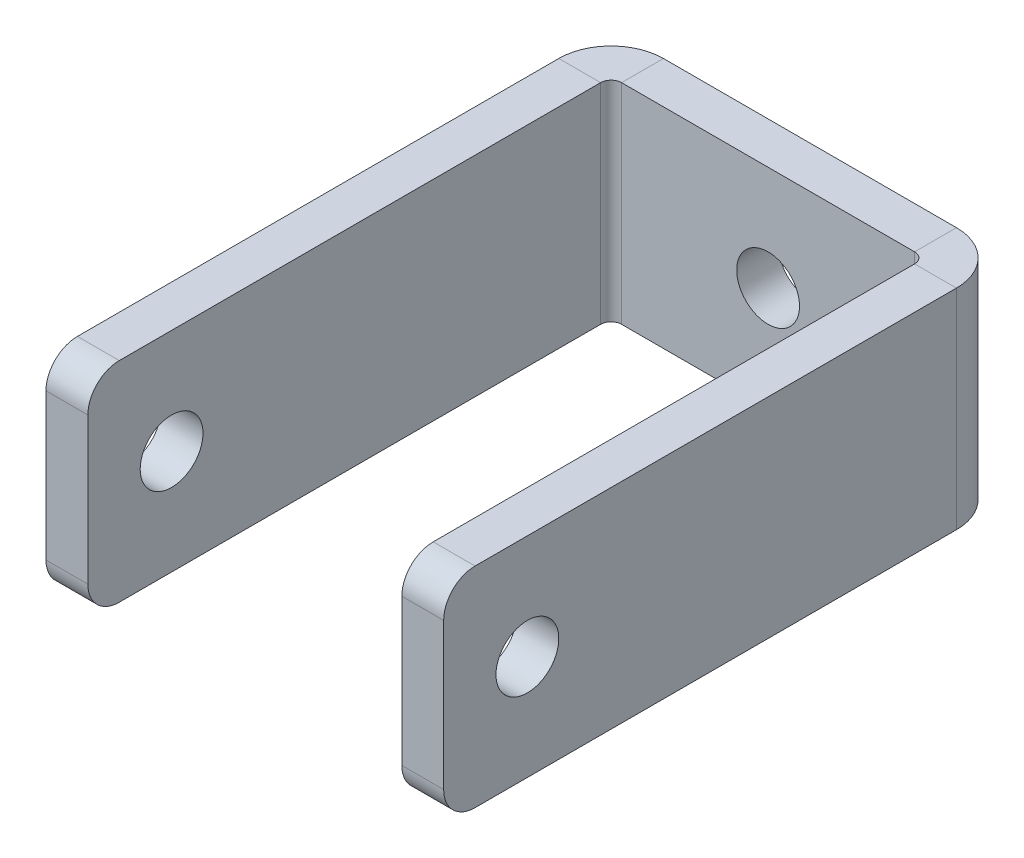
ISO-10303-21;
HEADER;
FILE_DESCRIPTION(('STEP AP214'),'2;1');
FILE_NAME('part.step','',(''),(''),'','','');
FILE_SCHEMA(('AUTOMOTIVE_DESIGN { 1 0 10303 214 1 1 1 1 }'));
ENDSEC;
DATA;
#1=APPLICATION_CONTEXT('core data for automotive mechanical design processes');
#2=APPLICATION_PROTOCOL_DEFINITION('international standard','automotive_design',2000,#1);
#3=PRODUCT_CONTEXT('',#1,'mechanical');
#4=PRODUCT('Part','Part','',(#3));
#5=PRODUCT_RELATED_PRODUCT_CATEGORY('part','',(#4));
#6=PRODUCT_DEFINITION_FORMATION('','',#4);
#7=PRODUCT_DEFINITION_CONTEXT('part definition',#1,'design');
#8=PRODUCT_DEFINITION('design','',#6,#7);
#9=PRODUCT_DEFINITION_SHAPE('','',#8);
#10=(LENGTH_UNIT() NAMED_UNIT(*) SI_UNIT(.MILLI.,.METRE.));
#11=(NAMED_UNIT(*) PLANE_ANGLE_UNIT() SI_UNIT($,.RADIAN.));
#12=(NAMED_UNIT(*) SI_UNIT($,.STERADIAN.) SOLID_ANGLE_UNIT());
#13=UNCERTAINTY_MEASURE_WITH_UNIT(LENGTH_MEASURE(1.E-05),#10,'distance_accuracy_value','');
#14=(GEOMETRIC_REPRESENTATION_CONTEXT(3) GLOBAL_UNCERTAINTY_ASSIGNED_CONTEXT((#13)) GLOBAL_UNIT_ASSIGNED_CONTEXT((#10,
#11,#12)) REPRESENTATION_CONTEXT('',''));
#15=CARTESIAN_POINT('',(0.,0.,0.));
#16=DIRECTION('',(0.,0.,1.));
#17=DIRECTION('',(1.,0.,0.));
#18=AXIS2_PLACEMENT_3D('',#15,#16,#17);
#19=CARTESIAN_POINT('',(0.,0.,-4.));
#20=DIRECTION('',(0.,0.,1.));
#21=DIRECTION('',(1.,0.,0.));
#22=AXIS2_PLACEMENT_3D('',#19,#20,#21);
#23=PLANE('',#22);
#24=CARTESIAN_POINT('',(0.,0.,-4.));
#25=DIRECTION('',(0.,0.,1.));
#26=DIRECTION('',(1.,0.,0.));
#27=AXIS2_PLACEMENT_3D('',#24,#25,#26);
#28=CIRCLE('',#27,3.);
#29=CARTESIAN_POINT('',(3.,0.,-4.));
#30=VERTEX_POINT('',#29);
#31=EDGE_CURVE('E365',#30,#30,#28,.T.);
#32=ORIENTED_EDGE('',*,*,#31,.T.);
#33=EDGE_LOOP('',(#32));
#34=FACE_BOUND('',#33,.T.);
#35=DIRECTION('',(0.,1.,0.));
#36=VECTOR('',#35,1.);
#37=CARTESIAN_POINT('',(14.,10.,-4.));
#38=LINE('',#37,#36);
#39=CARTESIAN_POINT('',(14.,10.,-4.));
#40=VERTEX_POINT('',#39);
#41=CARTESIAN_POINT('',(14.,-9.99999999999997,-4.));
#42=VERTEX_POINT('',#41);
#43=EDGE_CURVE('E163',#40,#42,#38,.F.);
#44=ORIENTED_EDGE('',*,*,#43,.T.);
#45=DIRECTION('',(1.,0.,0.));
#46=VECTOR('',#45,1.);
#47=CARTESIAN_POINT('',(15.,-10.,-4.));
#48=LINE('',#47,#46);
#49=CARTESIAN_POINT('',(-14.,-10.,-4.));
#50=VERTEX_POINT('',#49);
#51=EDGE_CURVE('E267',#50,#42,#48,.T.);
#52=ORIENTED_EDGE('',*,*,#51,.F.);
#53=DIRECTION('',(0.,-1.,0.));
#54=VECTOR('',#53,1.);
#55=CARTESIAN_POINT('',(-14.,-10.,-4.));
#56=LINE('',#55,#54);
#57=CARTESIAN_POINT('',(-14.,10.,-4.));
#58=VERTEX_POINT('',#57);
#59=EDGE_CURVE('E243',#50,#58,#56,.F.);
#60=ORIENTED_EDGE('',*,*,#59,.T.);
#61=DIRECTION('',(-1.,0.,0.));
#62=VECTOR('',#61,1.);
#63=CARTESIAN_POINT('',(15.,10.,-4.));
#64=LINE('',#63,#62);
#65=EDGE_CURVE('E270',#40,#58,#64,.T.);
#66=ORIENTED_EDGE('',*,*,#65,.F.);
#67=EDGE_LOOP('',(#44,#52,#60,#66));
#68=FACE_BOUND('',#67,.T.);
#69=ADVANCED_FACE('F39',(#34,#68),#23,.F.);
#70=CARTESIAN_POINT('',(0.,0.,0.));
#71=DIRECTION('',(0.,0.,1.));
#72=DIRECTION('',(1.,0.,0.));
#73=AXIS2_PLACEMENT_3D('',#70,#71,#72);
#74=PLANE('',#73);
#75=CARTESIAN_POINT('',(0.,0.,0.));
#76=DIRECTION('',(0.,0.,1.));
#77=DIRECTION('',(1.,0.,0.));
#78=AXIS2_PLACEMENT_3D('',#75,#76,#77);
#79=CIRCLE('',#78,3.);
#80=CARTESIAN_POINT('',(3.,0.,0.));
#81=VERTEX_POINT('',#80);
#82=EDGE_CURVE('E370',#81,#81,#79,.T.);
#83=ORIENTED_EDGE('',*,*,#82,.F.);
#84=EDGE_LOOP('',(#83));
#85=FACE_BOUND('',#84,.T.);
#86=DIRECTION('',(1.,0.,0.));
#87=VECTOR('',#86,1.);
#88=CARTESIAN_POINT('',(15.,-10.,0.));
#89=LINE('',#88,#87);
#90=CARTESIAN_POINT('',(-14.,-10.,0.));
#91=VERTEX_POINT('',#90);
#92=CARTESIAN_POINT('',(14.,-10.,0.));
#93=VERTEX_POINT('',#92);
#94=EDGE_CURVE('E264',#91,#93,#89,.T.);
#95=ORIENTED_EDGE('',*,*,#94,.T.);
#96=DIRECTION('',(0.,1.,0.));
#97=VECTOR('',#96,1.);
#98=CARTESIAN_POINT('',(14.,10.,0.));
#99=LINE('',#98,#97);
#100=CARTESIAN_POINT('',(14.,10.,0.));
#101=VERTEX_POINT('',#100);
#102=EDGE_CURVE('E210',#101,#93,#99,.F.);
#103=ORIENTED_EDGE('',*,*,#102,.F.);
#104=DIRECTION('',(-1.,0.,0.));
#105=VECTOR('',#104,1.);
#106=CARTESIAN_POINT('',(15.,10.,0.));
#107=LINE('',#106,#105);
#108=CARTESIAN_POINT('',(-14.,10.,0.));
#109=VERTEX_POINT('',#108);
#110=EDGE_CURVE('E271',#101,#109,#107,.T.);
#111=ORIENTED_EDGE('',*,*,#110,.T.);
#112=DIRECTION('',(0.,-1.,0.));
#113=VECTOR('',#112,1.);
#114=CARTESIAN_POINT('',(-14.,-10.,0.));
#115=LINE('',#114,#113);
#116=EDGE_CURVE('E256',#91,#109,#115,.F.);
#117=ORIENTED_EDGE('',*,*,#116,.F.);
#118=EDGE_LOOP('',(#95,#103,#111,#117));
#119=FACE_BOUND('',#118,.T.);
#120=ADVANCED_FACE('F348',(#85,#119),#74,.T.);
#121=CARTESIAN_POINT('',(15.,10.,-4.));
#122=DIRECTION('',(0.,1.,0.));
#123=DIRECTION('',(-1.,0.,0.));
#124=AXIS2_PLACEMENT_3D('',#121,#122,#123);
#125=PLANE('',#124);
#126=ORIENTED_EDGE('',*,*,#110,.F.);
#127=DIRECTION('',(0.,0.,-1.));
#128=VECTOR('',#127,1.);
#129=CARTESIAN_POINT('',(14.,10.,0.));
#130=LINE('',#129,#128);
#131=EDGE_CURVE('E206',#101,#40,#130,.T.);
#132=ORIENTED_EDGE('',*,*,#131,.T.);
#133=ORIENTED_EDGE('',*,*,#65,.T.);
#134=DIRECTION('',(0.,0.,-1.));
#135=VECTOR('',#134,1.);
#136=CARTESIAN_POINT('',(-14.,10.,0.));
#137=LINE('',#136,#135);
#138=EDGE_CURVE('E261',#109,#58,#137,.T.);
#139=ORIENTED_EDGE('',*,*,#138,.F.);
#140=EDGE_LOOP('',(#126,#132,#133,#139));
#141=FACE_BOUND('',#140,.T.);
#142=ADVANCED_FACE('F343',(#141),#125,.T.);
#143=CARTESIAN_POINT('',(15.,-10.,-4.));
#144=DIRECTION('',(0.,-1.,0.));
#145=DIRECTION('',(1.,0.,0.));
#146=AXIS2_PLACEMENT_3D('',#143,#144,#145);
#147=PLANE('',#146);
#148=DIRECTION('',(0.,0.,-1.));
#149=VECTOR('',#148,1.);
#150=CARTESIAN_POINT('',(14.,-10.,0.));
#151=LINE('',#150,#149);
#152=EDGE_CURVE('E214',#93,#42,#151,.T.);
#153=ORIENTED_EDGE('',*,*,#152,.F.);
#154=ORIENTED_EDGE('',*,*,#94,.F.);
#155=DIRECTION('',(0.,0.,-1.));
#156=VECTOR('',#155,1.);
#157=CARTESIAN_POINT('',(-14.,-10.,0.));
#158=LINE('',#157,#156);
#159=EDGE_CURVE('E250',#91,#50,#158,.T.);
#160=ORIENTED_EDGE('',*,*,#159,.T.);
#161=ORIENTED_EDGE('',*,*,#51,.T.);
#162=EDGE_LOOP('',(#153,#154,#160,#161));
#163=FACE_BOUND('',#162,.T.);
#164=ADVANCED_FACE('F350',(#163),#147,.T.);
#165=CARTESIAN_POINT('',(-14.,10.,1.));
#166=DIRECTION('',(0.,1.,0.));
#167=DIRECTION('',(0.,0.,1.));
#168=AXIS2_PLACEMENT_3D('',#165,#166,#167);
#169=PLANE('',#168);
#170=DIRECTION('',(-1.,0.,0.));
#171=VECTOR('',#170,1.);
#172=CARTESIAN_POINT('',(-15.,10.,0.999999999999997));
#173=LINE('',#172,#171);
#174=CARTESIAN_POINT('',(-15.,10.,0.999999999999997));
#175=VERTEX_POINT('',#174);
#176=CARTESIAN_POINT('',(-19.,10.,0.999999999999983));
#177=VERTEX_POINT('',#176);
#178=EDGE_CURVE('E217',#175,#177,#173,.T.);
#179=ORIENTED_EDGE('',*,*,#178,.F.);
#180=CARTESIAN_POINT('',(-14.,10.,1.));
#181=DIRECTION('',(0.,-1.,0.));
#182=DIRECTION('',(0.,0.,-1.));
#183=AXIS2_PLACEMENT_3D('',#180,#181,#182);
#184=CIRCLE('',#183,1.);
#185=EDGE_CURVE('E253',#109,#175,#184,.F.);
#186=ORIENTED_EDGE('',*,*,#185,.F.);
#187=ORIENTED_EDGE('',*,*,#138,.T.);
#188=CARTESIAN_POINT('',(-14.,10.,1.));
#189=DIRECTION('',(0.,-1.,0.));
#190=DIRECTION('',(0.,0.,-1.));
#191=AXIS2_PLACEMENT_3D('',#188,#189,#190);
#192=CIRCLE('',#191,5.);
#193=EDGE_CURVE('E246',#58,#177,#192,.F.);
#194=ORIENTED_EDGE('',*,*,#193,.T.);
#195=EDGE_LOOP('',(#179,#186,#187,#194));
#196=FACE_BOUND('',#195,.T.);
#197=ADVANCED_FACE('F338',(#196),#169,.T.);
#198=CARTESIAN_POINT('',(-14.,-10.,1.));
#199=DIRECTION('',(0.,1.,0.));
#200=DIRECTION('',(0.,0.,1.));
#201=AXIS2_PLACEMENT_3D('',#198,#199,#200);
#202=PLANE('',#201);
#203=CARTESIAN_POINT('',(-14.,-10.,1.));
#204=DIRECTION('',(0.,-1.,0.));
#205=DIRECTION('',(0.,0.,-1.));
#206=AXIS2_PLACEMENT_3D('',#203,#204,#205);
#207=CIRCLE('',#206,1.);
#208=CARTESIAN_POINT('',(-15.,-10.,0.999999999999997));
#209=VERTEX_POINT('',#208);
#210=EDGE_CURVE('E238',#209,#91,#207,.T.);
#211=ORIENTED_EDGE('',*,*,#210,.F.);
#212=DIRECTION('',(-1.,0.,0.));
#213=VECTOR('',#212,1.);
#214=CARTESIAN_POINT('',(-15.,-10.,0.999999999999997));
#215=LINE('',#214,#213);
#216=CARTESIAN_POINT('',(-19.,-10.,0.999999999999984));
#217=VERTEX_POINT('',#216);
#218=EDGE_CURVE('E222',#209,#217,#215,.T.);
#219=ORIENTED_EDGE('',*,*,#218,.T.);
#220=CARTESIAN_POINT('',(-14.,-10.,1.));
#221=DIRECTION('',(0.,-1.,0.));
#222=DIRECTION('',(0.,0.,-1.));
#223=AXIS2_PLACEMENT_3D('',#220,#221,#222);
#224=CIRCLE('',#223,5.);
#225=EDGE_CURVE('E247',#217,#50,#224,.T.);
#226=ORIENTED_EDGE('',*,*,#225,.T.);
#227=ORIENTED_EDGE('',*,*,#159,.F.);
#228=EDGE_LOOP('',(#211,#219,#226,#227));
#229=FACE_BOUND('',#228,.T.);
#230=ADVANCED_FACE('F331',(#229),#202,.F.);
#231=CARTESIAN_POINT('',(-14.,-10.,1.));
#232=DIRECTION('',(0.,-1.,0.));
#233=DIRECTION('',(-1.,0.,0.));
#234=AXIS2_PLACEMENT_3D('',#231,#232,#233);
#235=CYLINDRICAL_SURFACE('',#234,5.);
#236=ORIENTED_EDGE('',*,*,#59,.F.);
#237=ORIENTED_EDGE('',*,*,#225,.F.);
#238=DIRECTION('',(0.,1.,0.));
#239=VECTOR('',#238,1.);
#240=CARTESIAN_POINT('',(-19.,0.,0.999999999999984));
#241=LINE('',#240,#239);
#242=EDGE_CURVE('E225',#217,#177,#241,.T.);
#243=ORIENTED_EDGE('',*,*,#242,.T.);
#244=ORIENTED_EDGE('',*,*,#193,.F.);
#245=EDGE_LOOP('',(#236,#237,#243,#244));
#246=FACE_BOUND('',#245,.T.);
#247=ADVANCED_FACE('F336',(#246),#235,.T.);
#248=CARTESIAN_POINT('',(-14.,-10.,1.));
#249=DIRECTION('',(0.,-1.,0.));
#250=DIRECTION('',(-1.,0.,0.));
#251=AXIS2_PLACEMENT_3D('',#248,#249,#250);
#252=CYLINDRICAL_SURFACE('',#251,1.);
#253=ORIENTED_EDGE('',*,*,#116,.T.);
#254=ORIENTED_EDGE('',*,*,#185,.T.);
#255=DIRECTION('',(0.,-1.,0.));
#256=VECTOR('',#255,1.);
#257=CARTESIAN_POINT('',(-15.,10.,0.999999999999997));
#258=LINE('',#257,#256);
#259=EDGE_CURVE('E220',#175,#209,#258,.T.);
#260=ORIENTED_EDGE('',*,*,#259,.T.);
#261=ORIENTED_EDGE('',*,*,#210,.T.);
#262=EDGE_LOOP('',(#253,#254,#260,#261));
#263=FACE_BOUND('',#262,.T.);
#264=ADVANCED_FACE('F345',(#263),#252,.F.);
#265=CARTESIAN_POINT('',(-19.0000000000002,-10.,50.));
#266=DIRECTION('',(0.,1.,0.));
#267=DIRECTION('',(0.,0.,1.));
#268=AXIS2_PLACEMENT_3D('',#265,#266,#267);
#269=PLANE('',#268);
#270=DIRECTION('',(0.,0.,1.));
#271=VECTOR('',#270,1.);
#272=CARTESIAN_POINT('',(-15.0000000000002,-10.,50.));
#273=LINE('',#272,#271);
#274=CARTESIAN_POINT('',(-15.0000000000002,-10.,47.));
#275=VERTEX_POINT('',#274);
#276=EDGE_CURVE('E230',#209,#275,#273,.T.);
#277=ORIENTED_EDGE('',*,*,#276,.T.);
#278=DIRECTION('',(1.,0.,0.));
#279=VECTOR('',#278,1.);
#280=CARTESIAN_POINT('',(-19.0000000000002,-10.,47.));
#281=LINE('',#280,#279);
#282=CARTESIAN_POINT('',(-19.0000000000002,-10.,47.));
#283=VERTEX_POINT('',#282);
#284=EDGE_CURVE('E11',#275,#283,#281,.F.);
#285=ORIENTED_EDGE('',*,*,#284,.T.);
#286=DIRECTION('',(0.,0.,1.));
#287=VECTOR('',#286,1.);
#288=CARTESIAN_POINT('',(-19.0000000000002,-10.,50.));
#289=LINE('',#288,#287);
#290=EDGE_CURVE('E231',#217,#283,#289,.T.);
#291=ORIENTED_EDGE('',*,*,#290,.F.);
#292=ORIENTED_EDGE('',*,*,#218,.F.);
#293=EDGE_LOOP('',(#277,#285,#291,#292));
#294=FACE_BOUND('',#293,.T.);
#295=ADVANCED_FACE('F328',(#294),#269,.F.);
#296=CARTESIAN_POINT('',(-19.,10.,0.));
#297=DIRECTION('',(0.,-1.,0.));
#298=DIRECTION('',(0.,0.,-1.));
#299=AXIS2_PLACEMENT_3D('',#296,#297,#298);
#300=PLANE('',#299);
#301=DIRECTION('',(0.,0.,-1.));
#302=VECTOR('',#301,1.);
#303=CARTESIAN_POINT('',(-19.,10.,0.));
#304=LINE('',#303,#302);
#305=CARTESIAN_POINT('',(-19.0000000000002,10.,47.));
#306=VERTEX_POINT('',#305);
#307=EDGE_CURVE('E236',#306,#177,#304,.T.);
#308=ORIENTED_EDGE('',*,*,#307,.F.);
#309=DIRECTION('',(1.,0.,0.));
#310=VECTOR('',#309,1.);
#311=CARTESIAN_POINT('',(-19.0000000000002,10.,47.));
#312=LINE('',#311,#310);
#313=CARTESIAN_POINT('',(-15.0000000000002,10.,47.));
#314=VERTEX_POINT('',#313);
#315=EDGE_CURVE('E293',#306,#314,#312,.T.);
#316=ORIENTED_EDGE('',*,*,#315,.T.);
#317=DIRECTION('',(0.,0.,-1.));
#318=VECTOR('',#317,1.);
#319=CARTESIAN_POINT('',(-15.,10.,0.));
#320=LINE('',#319,#318);
#321=EDGE_CURVE('E234',#314,#175,#320,.T.);
#322=ORIENTED_EDGE('',*,*,#321,.T.);
#323=ORIENTED_EDGE('',*,*,#178,.T.);
#324=EDGE_LOOP('',(#308,#316,#322,#323));
#325=FACE_BOUND('',#324,.T.);
#326=ADVANCED_FACE('F314',(#325),#300,.F.);
#327=CARTESIAN_POINT('',(-19.,0.,0.));
#328=DIRECTION('',(1.,0.,0.));
#329=DIRECTION('',(0.,0.,-1.));
#330=AXIS2_PLACEMENT_3D('',#327,#328,#329);
#331=PLANE('',#330);
#332=CARTESIAN_POINT('',(-19.0000000000001,0.,42.));
#333=DIRECTION('',(-1.,0.,0.));
#334=DIRECTION('',(0.,0.,1.));
#335=AXIS2_PLACEMENT_3D('',#332,#333,#334);
#336=CIRCLE('',#335,3.);
#337=CARTESIAN_POINT('',(-19.0000000000002,0.,45.));
#338=VERTEX_POINT('',#337);
#339=EDGE_CURVE('E376',#338,#338,#336,.T.);
#340=ORIENTED_EDGE('',*,*,#339,.F.);
#341=EDGE_LOOP('',(#340));
#342=FACE_BOUND('',#341,.T.);
#343=DIRECTION('',(0.,1.,0.));
#344=VECTOR('',#343,1.);
#345=CARTESIAN_POINT('',(-19.0000000000002,10.,50.));
#346=LINE('',#345,#344);
#347=CARTESIAN_POINT('',(-19.0000000000002,-7.,50.));
#348=VERTEX_POINT('',#347);
#349=CARTESIAN_POINT('',(-19.0000000000002,7.,50.));
#350=VERTEX_POINT('',#349);
#351=EDGE_CURVE('E233',#348,#350,#346,.T.);
#352=ORIENTED_EDGE('',*,*,#351,.T.);
#353=CARTESIAN_POINT('',(-19.0000000000002,7.,47.));
#354=DIRECTION('',(1.,0.,0.));
#355=DIRECTION('',(0.,0.,-1.));
#356=AXIS2_PLACEMENT_3D('',#353,#354,#355);
#357=CIRCLE('',#356,3.);
#358=EDGE_CURVE('E48',#350,#306,#357,.F.);
#359=ORIENTED_EDGE('',*,*,#358,.T.);
#360=ORIENTED_EDGE('',*,*,#307,.T.);
#361=ORIENTED_EDGE('',*,*,#242,.F.);
#362=ORIENTED_EDGE('',*,*,#290,.T.);
#363=CARTESIAN_POINT('',(-19.0000000000002,-7.,47.));
#364=DIRECTION('',(1.,0.,0.));
#365=DIRECTION('',(0.,0.,-1.));
#366=AXIS2_PLACEMENT_3D('',#363,#364,#365);
#367=CIRCLE('',#366,3.);
#368=EDGE_CURVE('E304',#283,#348,#367,.F.);
#369=ORIENTED_EDGE('',*,*,#368,.T.);
#370=EDGE_LOOP('',(#352,#359,#360,#361,#362,#369));
#371=FACE_BOUND('',#370,.T.);
#372=ADVANCED_FACE('F309',(#342,#371),#331,.F.);
#373=CARTESIAN_POINT('',(-15.,0.,0.));
#374=DIRECTION('',(1.,0.,0.));
#375=DIRECTION('',(0.,0.,-1.));
#376=AXIS2_PLACEMENT_3D('',#373,#374,#375);
#377=PLANE('',#376);
#378=CARTESIAN_POINT('',(-15.0000000000001,0.,42.));
#379=DIRECTION('',(1.,0.,0.));
#380=DIRECTION('',(0.,0.,-1.));
#381=AXIS2_PLACEMENT_3D('',#378,#379,#380);
#382=CIRCLE('',#381,3.);
#383=CARTESIAN_POINT('',(-15.0000000000001,0.,39.));
#384=VERTEX_POINT('',#383);
#385=EDGE_CURVE('E373',#384,#384,#382,.T.);
#386=ORIENTED_EDGE('',*,*,#385,.F.);
#387=EDGE_LOOP('',(#386));
#388=FACE_BOUND('',#387,.T.);
#389=ORIENTED_EDGE('',*,*,#321,.F.);
#390=CARTESIAN_POINT('',(-15.0000000000002,7.,47.));
#391=DIRECTION('',(1.,0.,0.));
#392=DIRECTION('',(0.,0.,-1.));
#393=AXIS2_PLACEMENT_3D('',#390,#391,#392);
#394=CIRCLE('',#393,3.);
#395=CARTESIAN_POINT('',(-15.0000000000002,7.,50.));
#396=VERTEX_POINT('',#395);
#397=EDGE_CURVE('E298',#314,#396,#394,.T.);
#398=ORIENTED_EDGE('',*,*,#397,.T.);
#399=DIRECTION('',(0.,1.,0.));
#400=VECTOR('',#399,1.);
#401=CARTESIAN_POINT('',(-15.0000000000002,10.,50.));
#402=LINE('',#401,#400);
#403=CARTESIAN_POINT('',(-15.0000000000002,-7.,50.));
#404=VERTEX_POINT('',#403);
#405=EDGE_CURVE('E240',#404,#396,#402,.T.);
#406=ORIENTED_EDGE('',*,*,#405,.F.);
#407=CARTESIAN_POINT('',(-15.0000000000002,-7.,47.));
#408=DIRECTION('',(1.,0.,0.));
#409=DIRECTION('',(0.,0.,-1.));
#410=AXIS2_PLACEMENT_3D('',#407,#408,#409);
#411=CIRCLE('',#410,3.);
#412=EDGE_CURVE('E296',#404,#275,#411,.T.);
#413=ORIENTED_EDGE('',*,*,#412,.T.);
#414=ORIENTED_EDGE('',*,*,#276,.F.);
#415=ORIENTED_EDGE('',*,*,#259,.F.);
#416=EDGE_LOOP('',(#389,#398,#406,#413,#414,#415));
#417=FACE_BOUND('',#416,.T.);
#418=ADVANCED_FACE('F320',(#388,#417),#377,.T.);
#419=CARTESIAN_POINT('',(-19.0000000000002,10.,50.));
#420=DIRECTION('',(0.,0.,-1.));
#421=DIRECTION('',(-1.,0.,0.));
#422=AXIS2_PLACEMENT_3D('',#419,#420,#421);
#423=PLANE('',#422);
#424=ORIENTED_EDGE('',*,*,#405,.T.);
#425=DIRECTION('',(1.,0.,0.));
#426=VECTOR('',#425,1.);
#427=CARTESIAN_POINT('',(-19.0000000000002,7.,50.));
#428=LINE('',#427,#426);
#429=EDGE_CURVE('E61',#396,#350,#428,.F.);
#430=ORIENTED_EDGE('',*,*,#429,.T.);
#431=ORIENTED_EDGE('',*,*,#351,.F.);
#432=DIRECTION('',(1.,0.,0.));
#433=VECTOR('',#432,1.);
#434=CARTESIAN_POINT('',(-19.0000000000002,-7.,50.));
#435=LINE('',#434,#433);
#436=EDGE_CURVE('E300',#348,#404,#435,.T.);
#437=ORIENTED_EDGE('',*,*,#436,.T.);
#438=EDGE_LOOP('',(#424,#430,#431,#437));
#439=FACE_BOUND('',#438,.T.);
#440=ADVANCED_FACE('F322',(#439),#423,.F.);
#441=CARTESIAN_POINT('',(14.,-10.,1.));
#442=DIRECTION('',(0.,-1.,0.));
#443=DIRECTION('',(0.,0.,-1.));
#444=AXIS2_PLACEMENT_3D('',#441,#442,#443);
#445=PLANE('',#444);
#446=DIRECTION('',(1.,0.,0.));
#447=VECTOR('',#446,1.);
#448=CARTESIAN_POINT('',(15.,-10.,0.999999999999997));
#449=LINE('',#448,#447);
#450=CARTESIAN_POINT('',(15.,-10.,0.999999999999997));
#451=VERTEX_POINT('',#450);
#452=CARTESIAN_POINT('',(19.,-10.,0.999999999999983));
#453=VERTEX_POINT('',#452);
#454=EDGE_CURVE('E356',#451,#453,#449,.T.);
#455=ORIENTED_EDGE('',*,*,#454,.F.);
#456=CARTESIAN_POINT('',(14.,-10.,1.));
#457=DIRECTION('',(0.,1.,0.));
#458=DIRECTION('',(0.,0.,1.));
#459=AXIS2_PLACEMENT_3D('',#456,#457,#458);
#460=CIRCLE('',#459,1.);
#461=EDGE_CURVE('E166',#93,#451,#460,.F.);
#462=ORIENTED_EDGE('',*,*,#461,.F.);
#463=ORIENTED_EDGE('',*,*,#152,.T.);
#464=CARTESIAN_POINT('',(14.,-10.,1.));
#465=DIRECTION('',(0.,1.,0.));
#466=DIRECTION('',(0.,0.,1.));
#467=AXIS2_PLACEMENT_3D('',#464,#465,#466);
#468=CIRCLE('',#467,5.);
#469=EDGE_CURVE('E205',#42,#453,#468,.F.);
#470=ORIENTED_EDGE('',*,*,#469,.T.);
#471=EDGE_LOOP('',(#455,#462,#463,#470));
#472=FACE_BOUND('',#471,.T.);
#473=ADVANCED_FACE('F354',(#472),#445,.T.);
#474=CARTESIAN_POINT('',(14.,10.,1.));
#475=DIRECTION('',(0.,-1.,0.));
#476=DIRECTION('',(0.,0.,-1.));
#477=AXIS2_PLACEMENT_3D('',#474,#475,#476);
#478=PLANE('',#477);
#479=CARTESIAN_POINT('',(14.,10.,1.));
#480=DIRECTION('',(0.,1.,0.));
#481=DIRECTION('',(0.,0.,1.));
#482=AXIS2_PLACEMENT_3D('',#479,#480,#481);
#483=CIRCLE('',#482,1.);
#484=CARTESIAN_POINT('',(15.,10.,0.999999999999997));
#485=VERTEX_POINT('',#484);
#486=EDGE_CURVE('E173',#485,#101,#483,.T.);
#487=ORIENTED_EDGE('',*,*,#486,.F.);
#488=DIRECTION('',(1.,0.,0.));
#489=VECTOR('',#488,1.);
#490=CARTESIAN_POINT('',(15.,10.,0.999999999999997));
#491=LINE('',#490,#489);
#492=CARTESIAN_POINT('',(19.,10.,0.999999999999984));
#493=VERTEX_POINT('',#492);
#494=EDGE_CURVE('E170',#485,#493,#491,.T.);
#495=ORIENTED_EDGE('',*,*,#494,.T.);
#496=CARTESIAN_POINT('',(14.,10.,1.));
#497=DIRECTION('',(0.,1.,0.));
#498=DIRECTION('',(0.,0.,1.));
#499=AXIS2_PLACEMENT_3D('',#496,#497,#498);
#500=CIRCLE('',#499,5.);
#501=EDGE_CURVE('E156',#493,#40,#500,.T.);
#502=ORIENTED_EDGE('',*,*,#501,.T.);
#503=ORIENTED_EDGE('',*,*,#131,.F.);
#504=EDGE_LOOP('',(#487,#495,#502,#503));
#505=FACE_BOUND('',#504,.T.);
#506=ADVANCED_FACE('F171',(#505),#478,.F.);
#507=CARTESIAN_POINT('',(14.,10.,1.));
#508=DIRECTION('',(0.,1.,0.));
#509=DIRECTION('',(1.,0.,0.));
#510=AXIS2_PLACEMENT_3D('',#507,#508,#509);
#511=CYLINDRICAL_SURFACE('',#510,5.);
#512=ORIENTED_EDGE('',*,*,#43,.F.);
#513=ORIENTED_EDGE('',*,*,#501,.F.);
#514=DIRECTION('',(0.,-1.,0.));
#515=VECTOR('',#514,1.);
#516=CARTESIAN_POINT('',(19.,0.,0.999999999999984));
#517=LINE('',#516,#515);
#518=EDGE_CURVE('E161',#493,#453,#517,.T.);
#519=ORIENTED_EDGE('',*,*,#518,.T.);
#520=ORIENTED_EDGE('',*,*,#469,.F.);
#521=EDGE_LOOP('',(#512,#513,#519,#520));
#522=FACE_BOUND('',#521,.T.);
#523=ADVANCED_FACE('F158',(#522),#511,.T.);
#524=CARTESIAN_POINT('',(14.,10.,1.));
#525=DIRECTION('',(0.,1.,0.));
#526=DIRECTION('',(1.,0.,0.));
#527=AXIS2_PLACEMENT_3D('',#524,#525,#526);
#528=CYLINDRICAL_SURFACE('',#527,1.);
#529=ORIENTED_EDGE('',*,*,#102,.T.);
#530=ORIENTED_EDGE('',*,*,#461,.T.);
#531=DIRECTION('',(0.,1.,0.));
#532=VECTOR('',#531,1.);
#533=CARTESIAN_POINT('',(15.,-10.,0.999999999999997));
#534=LINE('',#533,#532);
#535=EDGE_CURVE('E178',#451,#485,#534,.T.);
#536=ORIENTED_EDGE('',*,*,#535,.T.);
#537=ORIENTED_EDGE('',*,*,#486,.T.);
#538=EDGE_LOOP('',(#529,#530,#536,#537));
#539=FACE_BOUND('',#538,.T.);
#540=ADVANCED_FACE('F359',(#539),#528,.F.);
#541=CARTESIAN_POINT('',(19.,-10.,0.));
#542=DIRECTION('',(0.,1.,0.));
#543=DIRECTION('',(0.,0.,1.));
#544=AXIS2_PLACEMENT_3D('',#541,#542,#543);
#545=PLANE('',#544);
#546=DIRECTION('',(0.,0.,-1.));
#547=VECTOR('',#546,1.);
#548=CARTESIAN_POINT('',(19.,-10.,0.));
#549=LINE('',#548,#547);
#550=CARTESIAN_POINT('',(19.0000000000002,-10.,47.));
#551=VERTEX_POINT('',#550);
#552=EDGE_CURVE('E186',#551,#453,#549,.T.);
#553=ORIENTED_EDGE('',*,*,#552,.F.);
#554=DIRECTION('',(-1.,0.,0.));
#555=VECTOR('',#554,1.);
#556=CARTESIAN_POINT('',(19.0000000000002,-10.,47.));
#557=LINE('',#556,#555);
#558=CARTESIAN_POINT('',(15.0000000000002,-10.,47.));
#559=VERTEX_POINT('',#558);
#560=EDGE_CURVE('E290',#551,#559,#557,.T.);
#561=ORIENTED_EDGE('',*,*,#560,.T.);
#562=DIRECTION('',(0.,0.,-1.));
#563=VECTOR('',#562,1.);
#564=CARTESIAN_POINT('',(15.,-10.,0.));
#565=LINE('',#564,#563);
#566=EDGE_CURVE('E187',#559,#451,#565,.T.);
#567=ORIENTED_EDGE('',*,*,#566,.T.);
#568=ORIENTED_EDGE('',*,*,#454,.T.);
#569=EDGE_LOOP('',(#553,#561,#567,#568));
#570=FACE_BOUND('',#569,.T.);
#571=ADVANCED_FACE('F510',(#570),#545,.F.);
#572=CARTESIAN_POINT('',(19.0000000000002,10.,50.));
#573=DIRECTION('',(0.,-1.,0.));
#574=DIRECTION('',(0.,0.,-1.));
#575=AXIS2_PLACEMENT_3D('',#572,#573,#574);
#576=PLANE('',#575);
#577=DIRECTION('',(0.,0.,1.));
#578=VECTOR('',#577,1.);
#579=CARTESIAN_POINT('',(15.0000000000002,10.,50.));
#580=LINE('',#579,#578);
#581=CARTESIAN_POINT('',(15.0000000000002,10.,47.));
#582=VERTEX_POINT('',#581);
#583=EDGE_CURVE('E200',#485,#582,#580,.T.);
#584=ORIENTED_EDGE('',*,*,#583,.T.);
#585=DIRECTION('',(-1.,0.,0.));
#586=VECTOR('',#585,1.);
#587=CARTESIAN_POINT('',(19.0000000000002,10.,47.));
#588=LINE('',#587,#586);
#589=CARTESIAN_POINT('',(19.0000000000002,10.,47.));
#590=VERTEX_POINT('',#589);
#591=EDGE_CURVE('E191',#582,#590,#588,.F.);
#592=ORIENTED_EDGE('',*,*,#591,.T.);
#593=DIRECTION('',(0.,0.,1.));
#594=VECTOR('',#593,1.);
#595=CARTESIAN_POINT('',(19.0000000000002,10.,50.));
#596=LINE('',#595,#594);
#597=EDGE_CURVE('E183',#493,#590,#596,.T.);
#598=ORIENTED_EDGE('',*,*,#597,.F.);
#599=ORIENTED_EDGE('',*,*,#494,.F.);
#600=EDGE_LOOP('',(#584,#592,#598,#599));
#601=FACE_BOUND('',#600,.T.);
#602=ADVANCED_FACE('F189',(#601),#576,.F.);
#603=CARTESIAN_POINT('',(19.,0.,0.));
#604=DIRECTION('',(-1.,0.,0.));
#605=DIRECTION('',(0.,0.,1.));
#606=AXIS2_PLACEMENT_3D('',#603,#604,#605);
#607=PLANE('',#606);
#608=CARTESIAN_POINT('',(19.0000000000002,0.,42.0000000000001));
#609=DIRECTION('',(-1.,0.,0.));
#610=DIRECTION('',(0.,0.,1.));
#611=AXIS2_PLACEMENT_3D('',#608,#609,#610);
#612=CIRCLE('',#611,3.);
#613=CARTESIAN_POINT('',(19.0000000000002,0.,45.0000000000001));
#614=VERTEX_POINT('',#613);
#615=EDGE_CURVE('E379',#614,#614,#612,.T.);
#616=ORIENTED_EDGE('',*,*,#615,.T.);
#617=EDGE_LOOP('',(#616));
#618=FACE_BOUND('',#617,.T.);
#619=ORIENTED_EDGE('',*,*,#597,.T.);
#620=CARTESIAN_POINT('',(19.0000000000002,7.,47.));
#621=DIRECTION('',(-1.,0.,0.));
#622=DIRECTION('',(0.,0.,1.));
#623=AXIS2_PLACEMENT_3D('',#620,#621,#622);
#624=CIRCLE('',#623,3.);
#625=CARTESIAN_POINT('',(19.0000000000002,7.,50.));
#626=VERTEX_POINT('',#625);
#627=EDGE_CURVE('E288',#590,#626,#624,.F.);
#628=ORIENTED_EDGE('',*,*,#627,.T.);
#629=DIRECTION('',(0.,-1.,0.));
#630=VECTOR('',#629,1.);
#631=CARTESIAN_POINT('',(19.0000000000002,-10.,50.));
#632=LINE('',#631,#630);
#633=CARTESIAN_POINT('',(19.0000000000002,-7.,50.));
#634=VERTEX_POINT('',#633);
#635=EDGE_CURVE('E192',#626,#634,#632,.T.);
#636=ORIENTED_EDGE('',*,*,#635,.T.);
#637=CARTESIAN_POINT('',(19.0000000000002,-7.,47.));
#638=DIRECTION('',(-1.,0.,0.));
#639=DIRECTION('',(0.,0.,1.));
#640=AXIS2_PLACEMENT_3D('',#637,#638,#639);
#641=CIRCLE('',#640,3.);
#642=EDGE_CURVE('E286',#634,#551,#641,.F.);
#643=ORIENTED_EDGE('',*,*,#642,.T.);
#644=ORIENTED_EDGE('',*,*,#552,.T.);
#645=ORIENTED_EDGE('',*,*,#518,.F.);
#646=EDGE_LOOP('',(#619,#628,#636,#643,#644,#645));
#647=FACE_BOUND('',#646,.T.);
#648=ADVANCED_FACE('F182',(#618,#647),#607,.F.);
#649=CARTESIAN_POINT('',(15.,0.,0.));
#650=DIRECTION('',(-1.,0.,0.));
#651=DIRECTION('',(0.,0.,1.));
#652=AXIS2_PLACEMENT_3D('',#649,#650,#651);
#653=PLANE('',#652);
#654=CARTESIAN_POINT('',(15.0000000000001,0.,42.0000000000001));
#655=DIRECTION('',(-1.,0.,0.));
#656=DIRECTION('',(0.,0.,1.));
#657=AXIS2_PLACEMENT_3D('',#654,#655,#656);
#658=CIRCLE('',#657,3.);
#659=CARTESIAN_POINT('',(15.0000000000002,0.,45.0000000000001));
#660=VERTEX_POINT('',#659);
#661=EDGE_CURVE('E43',#660,#660,#658,.T.);
#662=ORIENTED_EDGE('',*,*,#661,.F.);
#663=EDGE_LOOP('',(#662));
#664=FACE_BOUND('',#663,.T.);
#665=DIRECTION('',(0.,-1.,0.));
#666=VECTOR('',#665,1.);
#667=CARTESIAN_POINT('',(15.0000000000002,-10.,50.));
#668=LINE('',#667,#666);
#669=CARTESIAN_POINT('',(15.0000000000002,7.,50.));
#670=VERTEX_POINT('',#669);
#671=CARTESIAN_POINT('',(15.0000000000002,-7.,50.));
#672=VERTEX_POINT('',#671);
#673=EDGE_CURVE('E196',#670,#672,#668,.T.);
#674=ORIENTED_EDGE('',*,*,#673,.F.);
#675=CARTESIAN_POINT('',(15.0000000000002,7.,47.));
#676=DIRECTION('',(-1.,0.,0.));
#677=DIRECTION('',(0.,0.,1.));
#678=AXIS2_PLACEMENT_3D('',#675,#676,#677);
#679=CIRCLE('',#678,3.);
#680=EDGE_CURVE('E283',#670,#582,#679,.T.);
#681=ORIENTED_EDGE('',*,*,#680,.T.);
#682=ORIENTED_EDGE('',*,*,#583,.F.);
#683=ORIENTED_EDGE('',*,*,#535,.F.);
#684=ORIENTED_EDGE('',*,*,#566,.F.);
#685=CARTESIAN_POINT('',(15.0000000000002,-7.,47.));
#686=DIRECTION('',(-1.,0.,0.));
#687=DIRECTION('',(0.,0.,1.));
#688=AXIS2_PLACEMENT_3D('',#685,#686,#687);
#689=CIRCLE('',#688,3.);
#690=EDGE_CURVE('E281',#559,#672,#689,.T.);
#691=ORIENTED_EDGE('',*,*,#690,.T.);
#692=EDGE_LOOP('',(#674,#681,#682,#683,#684,#691));
#693=FACE_BOUND('',#692,.T.);
#694=ADVANCED_FACE('F363',(#664,#693),#653,.T.);
#695=CARTESIAN_POINT('',(19.0000000000002,-10.,50.));
#696=DIRECTION('',(0.,0.,-1.));
#697=DIRECTION('',(-1.,0.,0.));
#698=AXIS2_PLACEMENT_3D('',#695,#696,#697);
#699=PLANE('',#698);
#700=ORIENTED_EDGE('',*,*,#635,.F.);
#701=DIRECTION('',(-1.,0.,0.));
#702=VECTOR('',#701,1.);
#703=CARTESIAN_POINT('',(19.0000000000002,7.,50.));
#704=LINE('',#703,#702);
#705=EDGE_CURVE('E278',#626,#670,#704,.T.);
#706=ORIENTED_EDGE('',*,*,#705,.T.);
#707=ORIENTED_EDGE('',*,*,#673,.T.);
#708=DIRECTION('',(-1.,0.,0.));
#709=VECTOR('',#708,1.);
#710=CARTESIAN_POINT('',(19.0000000000002,-7.,50.));
#711=LINE('',#710,#709);
#712=EDGE_CURVE('E273',#672,#634,#711,.F.);
#713=ORIENTED_EDGE('',*,*,#712,.T.);
#714=EDGE_LOOP('',(#700,#706,#707,#713));
#715=FACE_BOUND('',#714,.T.);
#716=ADVANCED_FACE('F390',(#715),#699,.F.);
#717=CARTESIAN_POINT('',(19.0000000000002,7.,47.));
#718=DIRECTION('',(-1.,0.,0.));
#719=DIRECTION('',(0.,0.,1.));
#720=AXIS2_PLACEMENT_3D('',#717,#718,#719);
#721=CYLINDRICAL_SURFACE('',#720,3.);
#722=ORIENTED_EDGE('',*,*,#627,.F.);
#723=ORIENTED_EDGE('',*,*,#591,.F.);
#724=ORIENTED_EDGE('',*,*,#680,.F.);
#725=ORIENTED_EDGE('',*,*,#705,.F.);
#726=EDGE_LOOP('',(#722,#723,#724,#725));
#727=FACE_BOUND('',#726,.T.);
#728=ADVANCED_FACE('F396',(#727),#721,.T.);
#729=CARTESIAN_POINT('',(19.0000000000002,-7.,47.));
#730=DIRECTION('',(-1.,0.,0.));
#731=DIRECTION('',(0.,0.,1.));
#732=AXIS2_PLACEMENT_3D('',#729,#730,#731);
#733=CYLINDRICAL_SURFACE('',#732,3.);
#734=ORIENTED_EDGE('',*,*,#642,.F.);
#735=ORIENTED_EDGE('',*,*,#712,.F.);
#736=ORIENTED_EDGE('',*,*,#690,.F.);
#737=ORIENTED_EDGE('',*,*,#560,.F.);
#738=EDGE_LOOP('',(#734,#735,#736,#737));
#739=FACE_BOUND('',#738,.T.);
#740=ADVANCED_FACE('F418',(#739),#733,.T.);
#741=CARTESIAN_POINT('',(-19.0000000000002,7.,47.));
#742=DIRECTION('',(1.,0.,0.));
#743=DIRECTION('',(0.,0.,-1.));
#744=AXIS2_PLACEMENT_3D('',#741,#742,#743);
#745=CYLINDRICAL_SURFACE('',#744,3.);
#746=ORIENTED_EDGE('',*,*,#358,.F.);
#747=ORIENTED_EDGE('',*,*,#429,.F.);
#748=ORIENTED_EDGE('',*,*,#397,.F.);
#749=ORIENTED_EDGE('',*,*,#315,.F.);
#750=EDGE_LOOP('',(#746,#747,#748,#749));
#751=FACE_BOUND('',#750,.T.);
#752=ADVANCED_FACE('F317',(#751),#745,.T.);
#753=CARTESIAN_POINT('',(-19.0000000000002,-7.,47.));
#754=DIRECTION('',(1.,0.,0.));
#755=DIRECTION('',(0.,0.,-1.));
#756=AXIS2_PLACEMENT_3D('',#753,#754,#755);
#757=CYLINDRICAL_SURFACE('',#756,3.);
#758=ORIENTED_EDGE('',*,*,#368,.F.);
#759=ORIENTED_EDGE('',*,*,#284,.F.);
#760=ORIENTED_EDGE('',*,*,#412,.F.);
#761=ORIENTED_EDGE('',*,*,#436,.F.);
#762=EDGE_LOOP('',(#758,#759,#760,#761));
#763=FACE_BOUND('',#762,.T.);
#764=ADVANCED_FACE('F41',(#763),#757,.T.);
#765=CARTESIAN_POINT('',(0.,0.,-10.));
#766=DIRECTION('',(0.,0.,1.));
#767=DIRECTION('',(1.,0.,0.));
#768=AXIS2_PLACEMENT_3D('',#765,#766,#767);
#769=CYLINDRICAL_SURFACE('',#768,3.);
#770=ORIENTED_EDGE('',*,*,#82,.T.);
#771=EDGE_LOOP('',(#770));
#772=FACE_BOUND('',#771,.T.);
#773=ORIENTED_EDGE('',*,*,#31,.F.);
#774=EDGE_LOOP('',(#773));
#775=FACE_BOUND('',#774,.T.);
#776=ADVANCED_FACE('F426',(#772,#775),#769,.F.);
#777=CARTESIAN_POINT('',(19.0000000000002,0.,42.0000000000001));
#778=DIRECTION('',(-1.,0.,0.));
#779=DIRECTION('',(0.,0.,1.));
#780=AXIS2_PLACEMENT_3D('',#777,#778,#779);
#781=CYLINDRICAL_SURFACE('',#780,3.);
#782=ORIENTED_EDGE('',*,*,#661,.T.);
#783=EDGE_LOOP('',(#782));
#784=FACE_BOUND('',#783,.T.);
#785=ORIENTED_EDGE('',*,*,#615,.F.);
#786=EDGE_LOOP('',(#785));
#787=FACE_BOUND('',#786,.T.);
#788=ADVANCED_FACE('F386',(#784,#787),#781,.F.);
#789=ORIENTED_EDGE('',*,*,#385,.T.);
#790=EDGE_LOOP('',(#789));
#791=FACE_BOUND('',#790,.T.);
#792=ORIENTED_EDGE('',*,*,#339,.T.);
#793=EDGE_LOOP('',(#792));
#794=FACE_BOUND('',#793,.T.);
#795=ADVANCED_FACE('F435',(#791,#794),#781,.F.);
#796=CLOSED_SHELL('',(#69,#120,#142,#164,#197,#230,#247,#264,#295,#326,#372,#418,#440,#473,#506,
#523,#540,#571,#602,#648,#694,#716,#728,#740,#752,#764,#776,#788,#795));
#797=MANIFOLD_SOLID_BREP('B2',#796);
#798=ADVANCED_BREP_SHAPE_REPRESENTATION('',(#18,#797),#14);
#799=SHAPE_DEFINITION_REPRESENTATION(#9,#798);
ENDSEC;
END-ISO-10303-21;
